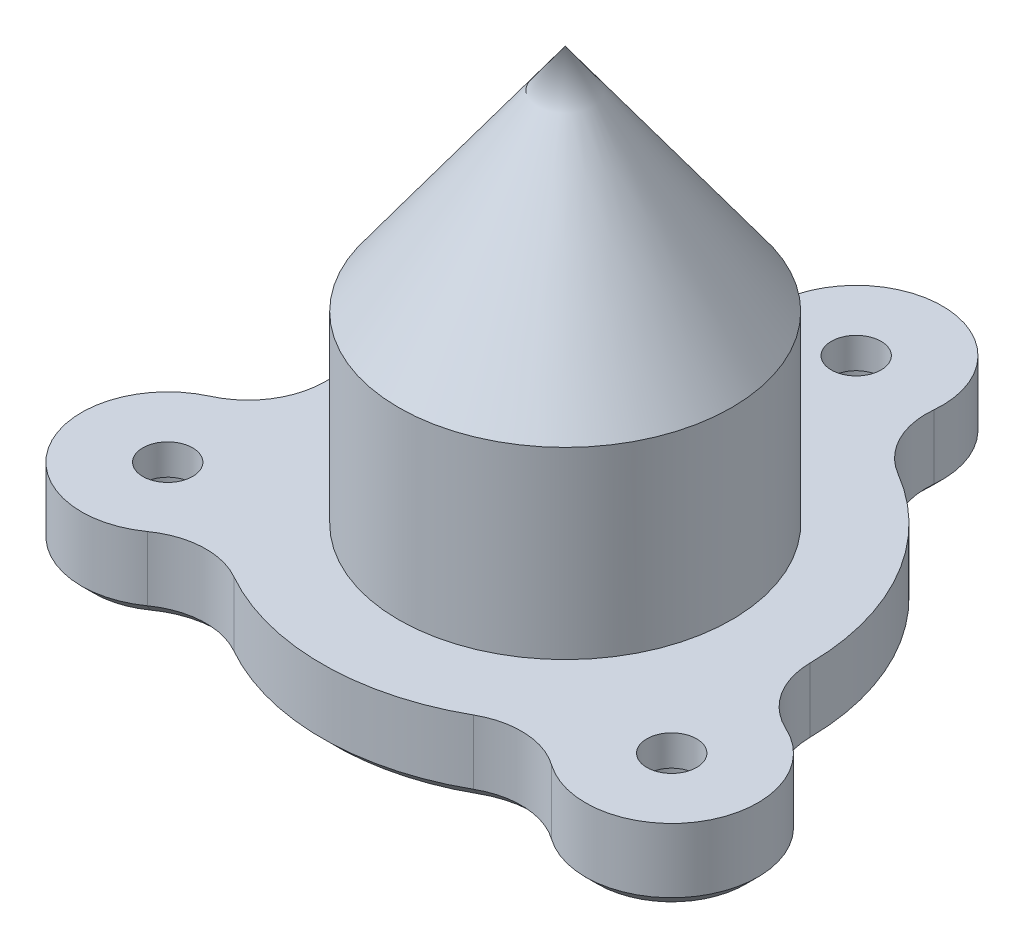
ISO-10303-21;
HEADER;
FILE_DESCRIPTION(('STEP AP214'),'2;1');
FILE_NAME('part.step','',(''),(''),'','','');
FILE_SCHEMA(('AUTOMOTIVE_DESIGN { 1 0 10303 214 1 1 1 1 }'));
ENDSEC;
DATA;
#1=APPLICATION_CONTEXT('core data for automotive mechanical design processes');
#2=APPLICATION_PROTOCOL_DEFINITION('international standard','automotive_design',2000,#1);
#3=PRODUCT_CONTEXT('',#1,'mechanical');
#4=PRODUCT('Part','Part','',(#3));
#5=PRODUCT_RELATED_PRODUCT_CATEGORY('part','',(#4));
#6=PRODUCT_DEFINITION_FORMATION('','',#4);
#7=PRODUCT_DEFINITION_CONTEXT('part definition',#1,'design');
#8=PRODUCT_DEFINITION('design','',#6,#7);
#9=PRODUCT_DEFINITION_SHAPE('','',#8);
#10=(LENGTH_UNIT() NAMED_UNIT(*) SI_UNIT(.MILLI.,.METRE.));
#11=(NAMED_UNIT(*) PLANE_ANGLE_UNIT() SI_UNIT($,.RADIAN.));
#12=(NAMED_UNIT(*) SI_UNIT($,.STERADIAN.) SOLID_ANGLE_UNIT());
#13=UNCERTAINTY_MEASURE_WITH_UNIT(LENGTH_MEASURE(1.E-05),#10,'distance_accuracy_value','');
#14=(GEOMETRIC_REPRESENTATION_CONTEXT(3) GLOBAL_UNCERTAINTY_ASSIGNED_CONTEXT((#13)) GLOBAL_UNIT_ASSIGNED_CONTEXT((#10,
#11,#12)) REPRESENTATION_CONTEXT('',''));
#15=CARTESIAN_POINT('',(0.,0.,0.));
#16=DIRECTION('',(0.,0.,1.));
#17=DIRECTION('',(1.,0.,0.));
#18=AXIS2_PLACEMENT_3D('',#15,#16,#17);
#19=CARTESIAN_POINT('',(0.,5.,-19.));
#20=DIRECTION('',(0.,-1.,0.));
#21=DIRECTION('',(0.,0.,-1.));
#22=AXIS2_PLACEMENT_3D('',#19,#20,#21);
#23=CYLINDRICAL_SURFACE('',#22,1.625);
#24=CARTESIAN_POINT('',(0.,5.,-19.));
#25=DIRECTION('',(0.,1.,0.));
#26=DIRECTION('',(0.,0.,1.));
#27=AXIS2_PLACEMENT_3D('',#24,#25,#26);
#28=CIRCLE('',#27,1.625);
#29=CARTESIAN_POINT('',(0.,5.,-17.375));
#30=VERTEX_POINT('',#29);
#31=EDGE_CURVE('E189',#30,#30,#28,.T.);
#32=ORIENTED_EDGE('',*,*,#31,.T.);
#33=EDGE_LOOP('',(#32));
#34=FACE_BOUND('',#33,.T.);
#35=CARTESIAN_POINT('',(0.,3.,-19.));
#36=DIRECTION('',(0.,-1.,0.));
#37=DIRECTION('',(0.,0.,-1.));
#38=AXIS2_PLACEMENT_3D('',#35,#36,#37);
#39=CIRCLE('',#38,1.625);
#40=CARTESIAN_POINT('',(0.,3.,-20.625));
#41=VERTEX_POINT('',#40);
#42=EDGE_CURVE('E305',#41,#41,#39,.T.);
#43=ORIENTED_EDGE('',*,*,#42,.T.);
#44=EDGE_LOOP('',(#43));
#45=FACE_BOUND('',#44,.T.);
#46=ADVANCED_FACE('F35',(#34,#45),#23,.F.);
#47=CARTESIAN_POINT('',(16.4544826719043,5.,9.5));
#48=DIRECTION('',(0.,-1.,0.));
#49=DIRECTION('',(0.,0.,-1.));
#50=AXIS2_PLACEMENT_3D('',#47,#48,#49);
#51=CYLINDRICAL_SURFACE('',#50,1.625);
#52=CARTESIAN_POINT('',(16.4544826719043,5.,9.5));
#53=DIRECTION('',(0.,1.,0.));
#54=DIRECTION('',(0.,0.,1.));
#55=AXIS2_PLACEMENT_3D('',#52,#53,#54);
#56=CIRCLE('',#55,1.625);
#57=CARTESIAN_POINT('',(16.4544826719043,5.,11.125));
#58=VERTEX_POINT('',#57);
#59=EDGE_CURVE('E178',#58,#58,#56,.T.);
#60=ORIENTED_EDGE('',*,*,#59,.T.);
#61=EDGE_LOOP('',(#60));
#62=FACE_BOUND('',#61,.T.);
#63=CARTESIAN_POINT('',(16.4544826719043,3.,9.5));
#64=DIRECTION('',(0.,-1.,0.));
#65=DIRECTION('',(0.,0.,-1.));
#66=AXIS2_PLACEMENT_3D('',#63,#64,#65);
#67=CIRCLE('',#66,1.625);
#68=CARTESIAN_POINT('',(16.4544826719043,3.,7.875));
#69=VERTEX_POINT('',#68);
#70=EDGE_CURVE('E336',#69,#69,#67,.T.);
#71=ORIENTED_EDGE('',*,*,#70,.T.);
#72=EDGE_LOOP('',(#71));
#73=FACE_BOUND('',#72,.T.);
#74=ADVANCED_FACE('F372',(#62,#73),#51,.F.);
#75=CARTESIAN_POINT('',(-16.4544826719043,5.,9.50000000000001));
#76=DIRECTION('',(0.,-1.,0.));
#77=DIRECTION('',(0.,0.,-1.));
#78=AXIS2_PLACEMENT_3D('',#75,#76,#77);
#79=CYLINDRICAL_SURFACE('',#78,1.625);
#80=CARTESIAN_POINT('',(-16.4544826719043,5.,9.50000000000001));
#81=DIRECTION('',(0.,1.,0.));
#82=DIRECTION('',(0.,0.,1.));
#83=AXIS2_PLACEMENT_3D('',#80,#81,#82);
#84=CIRCLE('',#83,1.625);
#85=CARTESIAN_POINT('',(-16.4544826719043,5.,11.125));
#86=VERTEX_POINT('',#85);
#87=EDGE_CURVE('E174',#86,#86,#84,.T.);
#88=ORIENTED_EDGE('',*,*,#87,.T.);
#89=EDGE_LOOP('',(#88));
#90=FACE_BOUND('',#89,.T.);
#91=CARTESIAN_POINT('',(-16.4544826719043,3.,9.50000000000001));
#92=DIRECTION('',(0.,-1.,0.));
#93=DIRECTION('',(0.,0.,-1.));
#94=AXIS2_PLACEMENT_3D('',#91,#92,#93);
#95=CIRCLE('',#94,1.625);
#96=CARTESIAN_POINT('',(-16.4544826719043,3.,7.87500000000001));
#97=VERTEX_POINT('',#96);
#98=EDGE_CURVE('E333',#97,#97,#95,.T.);
#99=ORIENTED_EDGE('',*,*,#98,.T.);
#100=EDGE_LOOP('',(#99));
#101=FACE_BOUND('',#100,.T.);
#102=ADVANCED_FACE('F378',(#90,#101),#79,.F.);
#103=CARTESIAN_POINT('',(5.28876250251404,5.,-8.9983552631579));
#104=DIRECTION('',(0.,1.,0.));
#105=DIRECTION('',(0.,0.,1.));
#106=AXIS2_PLACEMENT_3D('',#103,#104,#105);
#107=PLANE('',#106);
#108=ORIENTED_EDGE('',*,*,#59,.F.);
#109=EDGE_LOOP('',(#108));
#110=FACE_BOUND('',#109,.T.);
#111=CARTESIAN_POINT('',(0.,5.,0.));
#112=DIRECTION('',(0.,1.,0.));
#113=DIRECTION('',(0.,0.,1.));
#114=AXIS2_PLACEMENT_3D('',#111,#112,#113);
#115=CIRCLE('',#114,10.875);
#116=CARTESIAN_POINT('',(0.,5.,10.875));
#117=VERTEX_POINT('',#116);
#118=EDGE_CURVE('E192',#117,#117,#115,.T.);
#119=ORIENTED_EDGE('',*,*,#118,.F.);
#120=EDGE_LOOP('',(#119));
#121=FACE_BOUND('',#120,.T.);
#122=CARTESIAN_POINT('',(0.,5.,0.));
#123=DIRECTION('',(0.,1.,0.));
#124=DIRECTION('',(0.,0.,1.));
#125=AXIS2_PLACEMENT_3D('',#122,#123,#124);
#126=CIRCLE('',#125,15.875);
#127=CARTESIAN_POINT('',(15.8745216608563,5.,-0.123235705065375));
#128=VERTEX_POINT('',#127);
#129=CARTESIAN_POINT('',(8.04398608166807,5.,-13.6861211786952));
#130=VERTEX_POINT('',#129);
#131=EDGE_CURVE('E195',#128,#130,#126,.T.);
#132=ORIENTED_EDGE('',*,*,#131,.T.);
#133=CARTESIAN_POINT('',(10.5775250050281,5.,-17.9967105263158));
#134=DIRECTION('',(0.,-1.,0.));
#135=DIRECTION('',(0.,0.,1.));
#136=AXIS2_PLACEMENT_3D('',#133,#134,#135);
#137=CIRCLE('',#136,5.);
#138=CARTESIAN_POINT('',(5.59986617913252,5.,-18.468846749226));
#139=VERTEX_POINT('',#138);
#140=EDGE_CURVE('E198',#130,#139,#137,.T.);
#141=ORIENTED_EDGE('',*,*,#140,.T.);
#142=CARTESIAN_POINT('',(0.,5.,-19.));
#143=DIRECTION('',(0.,1.,0.));
#144=DIRECTION('',(0.,0.,1.));
#145=AXIS2_PLACEMENT_3D('',#142,#143,#144);
#146=CIRCLE('',#145,5.625);
#147=CARTESIAN_POINT('',(-5.59986617913252,5.,-18.468846749226));
#148=VERTEX_POINT('',#147);
#149=EDGE_CURVE('E200',#139,#148,#146,.T.);
#150=ORIENTED_EDGE('',*,*,#149,.T.);
#151=CARTESIAN_POINT('',(-10.5775250050281,5.,-17.9967105263158));
#152=DIRECTION('',(0.,-1.,0.));
#153=DIRECTION('',(0.,0.,-1.));
#154=AXIS2_PLACEMENT_3D('',#151,#152,#153);
#155=CIRCLE('',#154,5.);
#156=CARTESIAN_POINT('',(-8.04398608166807,5.,-13.6861211786952));
#157=VERTEX_POINT('',#156);
#158=EDGE_CURVE('E202',#148,#157,#155,.T.);
#159=ORIENTED_EDGE('',*,*,#158,.T.);
#160=CARTESIAN_POINT('',(0.,5.,0.));
#161=DIRECTION('',(0.,1.,0.));
#162=DIRECTION('',(0.,0.,1.));
#163=AXIS2_PLACEMENT_3D('',#160,#161,#162);
#164=CIRCLE('',#163,15.875);
#165=CARTESIAN_POINT('',(-15.8745216608563,5.,-0.123235705065376));
#166=VERTEX_POINT('',#165);
#167=EDGE_CURVE('E204',#157,#166,#164,.T.);
#168=ORIENTED_EDGE('',*,*,#167,.T.);
#169=CARTESIAN_POINT('',(-20.8743710028583,5.,-0.162050100361541));
#170=DIRECTION('',(0.,-1.,0.));
#171=DIRECTION('',(0.,0.,1.));
#172=AXIS2_PLACEMENT_3D('',#169,#170,#171);
#173=CIRCLE('',#172,5.);
#174=CARTESIAN_POINT('',(-18.7944235529976,5.,4.38479700569096));
#175=VERTEX_POINT('',#174);
#176=EDGE_CURVE('E206',#166,#175,#173,.T.);
#177=ORIENTED_EDGE('',*,*,#176,.T.);
#178=CARTESIAN_POINT('',(-16.4544826719043,5.,9.50000000000001));
#179=DIRECTION('',(0.,1.,0.));
#180=DIRECTION('',(0.,0.,1.));
#181=AXIS2_PLACEMENT_3D('',#178,#179,#180);
#182=CIRCLE('',#181,5.625);
#183=CARTESIAN_POINT('',(-13.1945573738651,5.,14.0840497435351));
#184=VERTEX_POINT('',#183);
#185=EDGE_CURVE('E208',#175,#184,#182,.T.);
#186=ORIENTED_EDGE('',*,*,#185,.T.);
#187=CARTESIAN_POINT('',(-10.2968459978302,5.,18.1587606266774));
#188=DIRECTION('',(0.,-1.,0.));
#189=DIRECTION('',(0.,0.,-1.));
#190=AXIS2_PLACEMENT_3D('',#187,#188,#189);
#191=CIRCLE('',#190,5.);
#192=CARTESIAN_POINT('',(-7.83053557918826,5.,13.8093568837606));
#193=VERTEX_POINT('',#192);
#194=EDGE_CURVE('E210',#184,#193,#191,.T.);
#195=ORIENTED_EDGE('',*,*,#194,.T.);
#196=CARTESIAN_POINT('',(0.,5.,0.));
#197=DIRECTION('',(0.,1.,0.));
#198=DIRECTION('',(0.,0.,1.));
#199=AXIS2_PLACEMENT_3D('',#196,#197,#198);
#200=CIRCLE('',#199,15.875);
#201=CARTESIAN_POINT('',(7.83053557918827,5.,13.8093568837606));
#202=VERTEX_POINT('',#201);
#203=EDGE_CURVE('E212',#193,#202,#200,.T.);
#204=ORIENTED_EDGE('',*,*,#203,.T.);
#205=CARTESIAN_POINT('',(10.2968459978303,5.,18.1587606266773));
#206=DIRECTION('',(0.,-1.,0.));
#207=DIRECTION('',(0.,0.,1.));
#208=AXIS2_PLACEMENT_3D('',#205,#206,#207);
#209=CIRCLE('',#208,5.);
#210=CARTESIAN_POINT('',(13.1945573738651,5.,14.0840497435351));
#211=VERTEX_POINT('',#210);
#212=EDGE_CURVE('E214',#202,#211,#209,.T.);
#213=ORIENTED_EDGE('',*,*,#212,.T.);
#214=CARTESIAN_POINT('',(16.4544826719043,5.,9.5));
#215=DIRECTION('',(0.,1.,0.));
#216=DIRECTION('',(0.,0.,1.));
#217=AXIS2_PLACEMENT_3D('',#214,#215,#216);
#218=CIRCLE('',#217,5.625);
#219=CARTESIAN_POINT('',(18.7944235529976,5.,4.38479700569094));
#220=VERTEX_POINT('',#219);
#221=EDGE_CURVE('E216',#211,#220,#218,.T.);
#222=ORIENTED_EDGE('',*,*,#221,.T.);
#223=CARTESIAN_POINT('',(20.8743710028583,5.,-0.162050100361556));
#224=DIRECTION('',(0.,-1.,0.));
#225=DIRECTION('',(0.,0.,-1.));
#226=AXIS2_PLACEMENT_3D('',#223,#224,#225);
#227=CIRCLE('',#226,5.);
#228=EDGE_CURVE('E218',#220,#128,#227,.T.);
#229=ORIENTED_EDGE('',*,*,#228,.T.);
#230=EDGE_LOOP('',(#132,#141,#150,#159,#168,#177,#186,#195,#204,#213,#222,#229));
#231=FACE_BOUND('',#230,.T.);
#232=ORIENTED_EDGE('',*,*,#31,.F.);
#233=EDGE_LOOP('',(#232));
#234=FACE_BOUND('',#233,.T.);
#235=ORIENTED_EDGE('',*,*,#87,.F.);
#236=EDGE_LOOP('',(#235));
#237=FACE_BOUND('',#236,.T.);
#238=ADVANCED_FACE('F384',(#110,#121,#231,#234,#237),#107,.T.);
#239=CARTESIAN_POINT('',(5.28876250251404,0.,-8.9983552631579));
#240=DIRECTION('',(0.,1.,0.));
#241=DIRECTION('',(0.,0.,1.));
#242=AXIS2_PLACEMENT_3D('',#239,#240,#241);
#243=PLANE('',#242);
#244=CARTESIAN_POINT('',(0.,0.,-19.));
#245=DIRECTION('',(0.,1.,0.));
#246=DIRECTION('',(0.,0.,1.));
#247=AXIS2_PLACEMENT_3D('',#244,#245,#246);
#248=CIRCLE('',#247,3.275);
#249=CARTESIAN_POINT('',(0.,0.,-15.725));
#250=VERTEX_POINT('',#249);
#251=EDGE_CURVE('E350',#250,#250,#248,.T.);
#252=ORIENTED_EDGE('',*,*,#251,.T.);
#253=EDGE_LOOP('',(#252));
#254=FACE_BOUND('',#253,.T.);
#255=CARTESIAN_POINT('',(-16.4544826719043,0.,9.50000000000008));
#256=DIRECTION('',(0.,1.,0.));
#257=DIRECTION('',(0.,0.,1.));
#258=AXIS2_PLACEMENT_3D('',#255,#256,#257);
#259=CIRCLE('',#258,3.275);
#260=CARTESIAN_POINT('',(-16.4544826719043,0.,12.7750000000001));
#261=VERTEX_POINT('',#260);
#262=EDGE_CURVE('E347',#261,#261,#259,.T.);
#263=ORIENTED_EDGE('',*,*,#262,.T.);
#264=EDGE_LOOP('',(#263));
#265=FACE_BOUND('',#264,.T.);
#266=CARTESIAN_POINT('',(16.4544826719044,0.,9.49999999999985));
#267=DIRECTION('',(0.,1.,0.));
#268=DIRECTION('',(0.,0.,1.));
#269=AXIS2_PLACEMENT_3D('',#266,#267,#268);
#270=CIRCLE('',#269,3.275);
#271=CARTESIAN_POINT('',(16.4544826719044,0.,12.7749999999998));
#272=VERTEX_POINT('',#271);
#273=EDGE_CURVE('E344',#272,#272,#270,.T.);
#274=ORIENTED_EDGE('',*,*,#273,.T.);
#275=EDGE_LOOP('',(#274));
#276=FACE_BOUND('',#275,.T.);
#277=CARTESIAN_POINT('',(-10.5775250050281,0.,-17.9967105263158));
#278=DIRECTION('',(0.,1.,0.));
#279=DIRECTION('',(0.,0.,1.));
#280=AXIS2_PLACEMENT_3D('',#277,#278,#279);
#281=CIRCLE('',#280,5.8);
#282=CARTESIAN_POINT('',(-7.63861985393046,0.,-12.996426883076));
#283=VERTEX_POINT('',#282);
#284=CARTESIAN_POINT('',(-4.80344076698922,0.,-18.5443885448916));
#285=VERTEX_POINT('',#284);
#286=EDGE_CURVE('E276',#283,#285,#281,.T.);
#287=ORIENTED_EDGE('',*,*,#286,.T.);
#288=CARTESIAN_POINT('',(0.,0.,-19.));
#289=DIRECTION('',(0.,1.,0.));
#290=DIRECTION('',(0.,0.,1.));
#291=AXIS2_PLACEMENT_3D('',#288,#289,#290);
#292=CIRCLE('',#291,4.825);
#293=CARTESIAN_POINT('',(4.80344076698922,0.,-18.5443885448916));
#294=VERTEX_POINT('',#293);
#295=EDGE_CURVE('E278',#285,#294,#292,.F.);
#296=ORIENTED_EDGE('',*,*,#295,.T.);
#297=CARTESIAN_POINT('',(10.5775250050281,0.,-17.9967105263158));
#298=DIRECTION('',(0.,1.,0.));
#299=DIRECTION('',(0.,0.,1.));
#300=AXIS2_PLACEMENT_3D('',#297,#298,#299);
#301=CIRCLE('',#300,5.8);
#302=CARTESIAN_POINT('',(7.63861985393046,0.,-12.996426883076));
#303=VERTEX_POINT('',#302);
#304=EDGE_CURVE('E274',#294,#303,#301,.T.);
#305=ORIENTED_EDGE('',*,*,#304,.T.);
#306=CARTESIAN_POINT('',(0.,0.,0.));
#307=DIRECTION('',(0.,1.,0.));
#308=DIRECTION('',(0.,0.,1.));
#309=AXIS2_PLACEMENT_3D('',#306,#307,#308);
#310=CIRCLE('',#309,15.075);
#311=CARTESIAN_POINT('',(15.074545766136,0.,-0.117025401817986));
#312=VERTEX_POINT('',#311);
#313=EDGE_CURVE('E270',#303,#312,#310,.F.);
#314=ORIENTED_EDGE('',*,*,#313,.T.);
#315=CARTESIAN_POINT('',(20.8743710028583,0.,-0.162050100361556));
#316=DIRECTION('',(0.,1.,0.));
#317=DIRECTION('',(0.,0.,1.));
#318=AXIS2_PLACEMENT_3D('',#315,#316,#317);
#319=CIRCLE('',#318,5.80000000000001);
#320=CARTESIAN_POINT('',(18.4616319610199,0.,5.11229254265934));
#321=VERTEX_POINT('',#320);
#322=EDGE_CURVE('E266',#312,#321,#319,.T.);
#323=ORIENTED_EDGE('',*,*,#322,.T.);
#324=CARTESIAN_POINT('',(16.4544826719043,0.,9.5));
#325=DIRECTION('',(0.,1.,0.));
#326=DIRECTION('',(0.,0.,1.));
#327=AXIS2_PLACEMENT_3D('',#324,#325,#326);
#328=CIRCLE('',#327,4.825);
#329=CARTESIAN_POINT('',(13.6581911940307,0.,13.4320960022323));
#330=VERTEX_POINT('',#329);
#331=EDGE_CURVE('E262',#321,#330,#328,.F.);
#332=ORIENTED_EDGE('',*,*,#331,.T.);
#333=CARTESIAN_POINT('',(10.2968459978303,0.,18.1587606266773));
#334=DIRECTION('',(0.,1.,0.));
#335=DIRECTION('',(0.,0.,1.));
#336=AXIS2_PLACEMENT_3D('',#333,#334,#335);
#337=CIRCLE('',#336,5.8);
#338=CARTESIAN_POINT('',(7.43592591220556,0.,13.1134522848939));
#339=VERTEX_POINT('',#338);
#340=EDGE_CURVE('E258',#330,#339,#337,.T.);
#341=ORIENTED_EDGE('',*,*,#340,.T.);
#342=CARTESIAN_POINT('',(0.,0.,0.));
#343=DIRECTION('',(0.,1.,0.));
#344=DIRECTION('',(0.,0.,1.));
#345=AXIS2_PLACEMENT_3D('',#342,#343,#344);
#346=CIRCLE('',#345,15.075);
#347=CARTESIAN_POINT('',(-7.43592591220555,0.,13.1134522848939));
#348=VERTEX_POINT('',#347);
#349=EDGE_CURVE('E256',#339,#348,#346,.F.);
#350=ORIENTED_EDGE('',*,*,#349,.T.);
#351=CARTESIAN_POINT('',(-10.2968459978302,0.,18.1587606266774));
#352=DIRECTION('',(0.,1.,0.));
#353=DIRECTION('',(0.,0.,1.));
#354=AXIS2_PLACEMENT_3D('',#351,#352,#353);
#355=CIRCLE('',#354,5.80000000000001);
#356=CARTESIAN_POINT('',(-13.6581911940307,0.,13.4320960022323));
#357=VERTEX_POINT('',#356);
#358=EDGE_CURVE('E260',#348,#357,#355,.T.);
#359=ORIENTED_EDGE('',*,*,#358,.T.);
#360=CARTESIAN_POINT('',(-16.4544826719043,0.,9.50000000000001));
#361=DIRECTION('',(0.,1.,0.));
#362=DIRECTION('',(0.,0.,1.));
#363=AXIS2_PLACEMENT_3D('',#360,#361,#362);
#364=CIRCLE('',#363,4.825);
#365=CARTESIAN_POINT('',(-18.4616319610199,0.,5.11229254265936));
#366=VERTEX_POINT('',#365);
#367=EDGE_CURVE('E264',#357,#366,#364,.F.);
#368=ORIENTED_EDGE('',*,*,#367,.T.);
#369=CARTESIAN_POINT('',(-20.8743710028583,0.,-0.162050100361541));
#370=DIRECTION('',(0.,1.,0.));
#371=DIRECTION('',(0.,0.,1.));
#372=AXIS2_PLACEMENT_3D('',#369,#370,#371);
#373=CIRCLE('',#372,5.8);
#374=CARTESIAN_POINT('',(-15.074545766136,0.,-0.117025401817987));
#375=VERTEX_POINT('',#374);
#376=EDGE_CURVE('E268',#366,#375,#373,.T.);
#377=ORIENTED_EDGE('',*,*,#376,.T.);
#378=CARTESIAN_POINT('',(0.,0.,0.));
#379=DIRECTION('',(0.,1.,0.));
#380=DIRECTION('',(0.,0.,1.));
#381=AXIS2_PLACEMENT_3D('',#378,#379,#380);
#382=CIRCLE('',#381,15.075);
#383=EDGE_CURVE('E272',#375,#283,#382,.F.);
#384=ORIENTED_EDGE('',*,*,#383,.T.);
#385=EDGE_LOOP('',(#287,#296,#305,#314,#323,#332,#341,#350,#359,#368,#377,#384));
#386=FACE_BOUND('',#385,.T.);
#387=ADVANCED_FACE('F387',(#254,#265,#276,#386),#243,.F.);
#388=CARTESIAN_POINT('',(0.,5.,0.));
#389=DIRECTION('',(0.,-1.,0.));
#390=DIRECTION('',(0.,0.,-1.));
#391=AXIS2_PLACEMENT_3D('',#388,#389,#390);
#392=CYLINDRICAL_SURFACE('',#391,15.875);
#393=DIRECTION('',(0.,-1.,0.));
#394=VECTOR('',#393,1.);
#395=CARTESIAN_POINT('',(15.8745216608563,5.,-0.123235705065375));
#396=LINE('',#395,#394);
#397=CARTESIAN_POINT('',(15.8745216608563,0.800000000000002,-0.123235705065375));
#398=VERTEX_POINT('',#397);
#399=EDGE_CURVE('E220',#128,#398,#396,.T.);
#400=ORIENTED_EDGE('',*,*,#399,.T.);
#401=CARTESIAN_POINT('',(0.,0.800000000000002,0.));
#402=DIRECTION('',(0.,1.,0.));
#403=DIRECTION('',(0.,0.,1.));
#404=AXIS2_PLACEMENT_3D('',#401,#402,#403);
#405=CIRCLE('',#404,15.875);
#406=CARTESIAN_POINT('',(8.04398608166807,0.800000000000002,-13.6861211786952));
#407=VERTEX_POINT('',#406);
#408=EDGE_CURVE('E287',#398,#407,#405,.T.);
#409=ORIENTED_EDGE('',*,*,#408,.T.);
#410=DIRECTION('',(0.,-1.,0.));
#411=VECTOR('',#410,1.);
#412=CARTESIAN_POINT('',(8.04398608166807,5.,-13.6861211786952));
#413=LINE('',#412,#411);
#414=EDGE_CURVE('E250',#130,#407,#413,.T.);
#415=ORIENTED_EDGE('',*,*,#414,.F.);
#416=ORIENTED_EDGE('',*,*,#131,.F.);
#417=EDGE_LOOP('',(#400,#409,#415,#416));
#418=FACE_BOUND('',#417,.T.);
#419=ADVANCED_FACE('F391',(#418),#392,.T.);
#420=CARTESIAN_POINT('',(10.5775250050281,5.,-17.9967105263158));
#421=DIRECTION('',(0.,-1.,0.));
#422=DIRECTION('',(0.,0.,-1.));
#423=AXIS2_PLACEMENT_3D('',#420,#421,#422);
#424=CYLINDRICAL_SURFACE('',#423,5.);
#425=ORIENTED_EDGE('',*,*,#414,.T.);
#426=CARTESIAN_POINT('',(10.5775250050281,0.800000000000002,-17.9967105263158));
#427=DIRECTION('',(0.,1.,0.));
#428=DIRECTION('',(0.,0.,1.));
#429=AXIS2_PLACEMENT_3D('',#426,#427,#428);
#430=CIRCLE('',#429,5.);
#431=CARTESIAN_POINT('',(5.59986617913252,0.800000000000002,-18.468846749226));
#432=VERTEX_POINT('',#431);
#433=EDGE_CURVE('E283',#407,#432,#430,.F.);
#434=ORIENTED_EDGE('',*,*,#433,.T.);
#435=DIRECTION('',(0.,-1.,0.));
#436=VECTOR('',#435,1.);
#437=CARTESIAN_POINT('',(5.59986617913252,5.,-18.468846749226));
#438=LINE('',#437,#436);
#439=EDGE_CURVE('E247',#139,#432,#438,.T.);
#440=ORIENTED_EDGE('',*,*,#439,.F.);
#441=ORIENTED_EDGE('',*,*,#140,.F.);
#442=EDGE_LOOP('',(#425,#434,#440,#441));
#443=FACE_BOUND('',#442,.T.);
#444=ADVANCED_FACE('F430',(#443),#424,.F.);
#445=CARTESIAN_POINT('',(0.,5.,-19.));
#446=DIRECTION('',(0.,-1.,0.));
#447=DIRECTION('',(0.,0.,-1.));
#448=AXIS2_PLACEMENT_3D('',#445,#446,#447);
#449=CYLINDRICAL_SURFACE('',#448,5.625);
#450=ORIENTED_EDGE('',*,*,#439,.T.);
#451=CARTESIAN_POINT('',(0.,0.800000000000002,-19.));
#452=DIRECTION('',(0.,1.,0.));
#453=DIRECTION('',(0.,0.,1.));
#454=AXIS2_PLACEMENT_3D('',#451,#452,#453);
#455=CIRCLE('',#454,5.625);
#456=CARTESIAN_POINT('',(-5.59986617913252,0.800000000000002,-18.468846749226));
#457=VERTEX_POINT('',#456);
#458=EDGE_CURVE('E253',#432,#457,#455,.T.);
#459=ORIENTED_EDGE('',*,*,#458,.T.);
#460=DIRECTION('',(0.,-1.,0.));
#461=VECTOR('',#460,1.);
#462=CARTESIAN_POINT('',(-5.59986617913252,5.,-18.468846749226));
#463=LINE('',#462,#461);
#464=EDGE_CURVE('E244',#148,#457,#463,.T.);
#465=ORIENTED_EDGE('',*,*,#464,.F.);
#466=ORIENTED_EDGE('',*,*,#149,.F.);
#467=EDGE_LOOP('',(#450,#459,#465,#466));
#468=FACE_BOUND('',#467,.T.);
#469=ADVANCED_FACE('F426',(#468),#449,.T.);
#470=CARTESIAN_POINT('',(-10.5775250050281,5.,-17.9967105263158));
#471=DIRECTION('',(0.,-1.,0.));
#472=DIRECTION('',(0.,0.,-1.));
#473=AXIS2_PLACEMENT_3D('',#470,#471,#472);
#474=CYLINDRICAL_SURFACE('',#473,5.);
#475=ORIENTED_EDGE('',*,*,#464,.T.);
#476=CARTESIAN_POINT('',(-10.5775250050281,0.800000000000002,-17.9967105263158));
#477=DIRECTION('',(0.,1.,0.));
#478=DIRECTION('',(0.,0.,1.));
#479=AXIS2_PLACEMENT_3D('',#476,#477,#478);
#480=CIRCLE('',#479,5.);
#481=CARTESIAN_POINT('',(-8.04398608166807,0.800000000000002,-13.6861211786952));
#482=VERTEX_POINT('',#481);
#483=EDGE_CURVE('E281',#457,#482,#480,.F.);
#484=ORIENTED_EDGE('',*,*,#483,.T.);
#485=DIRECTION('',(0.,-1.,0.));
#486=VECTOR('',#485,1.);
#487=CARTESIAN_POINT('',(-8.04398608166807,5.,-13.6861211786952));
#488=LINE('',#487,#486);
#489=EDGE_CURVE('E241',#157,#482,#488,.T.);
#490=ORIENTED_EDGE('',*,*,#489,.F.);
#491=ORIENTED_EDGE('',*,*,#158,.F.);
#492=EDGE_LOOP('',(#475,#484,#490,#491));
#493=FACE_BOUND('',#492,.T.);
#494=ADVANCED_FACE('F422',(#493),#474,.F.);
#495=CARTESIAN_POINT('',(0.,5.,0.));
#496=DIRECTION('',(0.,-1.,0.));
#497=DIRECTION('',(0.,0.,-1.));
#498=AXIS2_PLACEMENT_3D('',#495,#496,#497);
#499=CYLINDRICAL_SURFACE('',#498,15.875);
#500=ORIENTED_EDGE('',*,*,#489,.T.);
#501=CARTESIAN_POINT('',(0.,0.800000000000002,0.));
#502=DIRECTION('',(0.,1.,0.));
#503=DIRECTION('',(0.,0.,1.));
#504=AXIS2_PLACEMENT_3D('',#501,#502,#503);
#505=CIRCLE('',#504,15.875);
#506=CARTESIAN_POINT('',(-15.8745216608563,0.800000000000002,-0.123235705065376));
#507=VERTEX_POINT('',#506);
#508=EDGE_CURVE('E285',#482,#507,#505,.T.);
#509=ORIENTED_EDGE('',*,*,#508,.T.);
#510=DIRECTION('',(0.,-1.,0.));
#511=VECTOR('',#510,1.);
#512=CARTESIAN_POINT('',(-15.8745216608563,5.,-0.123235705065376));
#513=LINE('',#512,#511);
#514=EDGE_CURVE('E238',#166,#507,#513,.T.);
#515=ORIENTED_EDGE('',*,*,#514,.F.);
#516=ORIENTED_EDGE('',*,*,#167,.F.);
#517=EDGE_LOOP('',(#500,#509,#515,#516));
#518=FACE_BOUND('',#517,.T.);
#519=ADVANCED_FACE('F418',(#518),#499,.T.);
#520=CARTESIAN_POINT('',(-20.8743710028583,5.,-0.162050100361541));
#521=DIRECTION('',(0.,-1.,0.));
#522=DIRECTION('',(0.,0.,-1.));
#523=AXIS2_PLACEMENT_3D('',#520,#521,#522);
#524=CYLINDRICAL_SURFACE('',#523,5.);
#525=ORIENTED_EDGE('',*,*,#514,.T.);
#526=CARTESIAN_POINT('',(-20.8743710028583,0.800000000000002,-0.162050100361541));
#527=DIRECTION('',(0.,1.,0.));
#528=DIRECTION('',(0.,0.,1.));
#529=AXIS2_PLACEMENT_3D('',#526,#527,#528);
#530=CIRCLE('',#529,5.);
#531=CARTESIAN_POINT('',(-18.7944235529976,0.800000000000002,4.38479700569096));
#532=VERTEX_POINT('',#531);
#533=EDGE_CURVE('E289',#507,#532,#530,.F.);
#534=ORIENTED_EDGE('',*,*,#533,.T.);
#535=DIRECTION('',(0.,-1.,0.));
#536=VECTOR('',#535,1.);
#537=CARTESIAN_POINT('',(-18.7944235529976,5.,4.38479700569096));
#538=LINE('',#537,#536);
#539=EDGE_CURVE('E235',#175,#532,#538,.T.);
#540=ORIENTED_EDGE('',*,*,#539,.F.);
#541=ORIENTED_EDGE('',*,*,#176,.F.);
#542=EDGE_LOOP('',(#525,#534,#540,#541));
#543=FACE_BOUND('',#542,.T.);
#544=ADVANCED_FACE('F414',(#543),#524,.F.);
#545=CARTESIAN_POINT('',(-16.4544826719043,5.,9.50000000000001));
#546=DIRECTION('',(0.,-1.,0.));
#547=DIRECTION('',(0.,0.,-1.));
#548=AXIS2_PLACEMENT_3D('',#545,#546,#547);
#549=CYLINDRICAL_SURFACE('',#548,5.625);
#550=ORIENTED_EDGE('',*,*,#539,.T.);
#551=CARTESIAN_POINT('',(-16.4544826719043,0.800000000000002,9.50000000000001));
#552=DIRECTION('',(0.,1.,0.));
#553=DIRECTION('',(0.,0.,1.));
#554=AXIS2_PLACEMENT_3D('',#551,#552,#553);
#555=CIRCLE('',#554,5.625);
#556=CARTESIAN_POINT('',(-13.1945573738651,0.800000000000002,14.0840497435351));
#557=VERTEX_POINT('',#556);
#558=EDGE_CURVE('E293',#532,#557,#555,.T.);
#559=ORIENTED_EDGE('',*,*,#558,.T.);
#560=DIRECTION('',(0.,-1.,0.));
#561=VECTOR('',#560,1.);
#562=CARTESIAN_POINT('',(-13.1945573738651,5.,14.0840497435351));
#563=LINE('',#562,#561);
#564=EDGE_CURVE('E233',#184,#557,#563,.T.);
#565=ORIENTED_EDGE('',*,*,#564,.F.);
#566=ORIENTED_EDGE('',*,*,#185,.F.);
#567=EDGE_LOOP('',(#550,#559,#565,#566));
#568=FACE_BOUND('',#567,.T.);
#569=ADVANCED_FACE('F411',(#568),#549,.T.);
#570=CARTESIAN_POINT('',(-10.2968459978302,5.,18.1587606266774));
#571=DIRECTION('',(0.,-1.,0.));
#572=DIRECTION('',(0.,0.,-1.));
#573=AXIS2_PLACEMENT_3D('',#570,#571,#572);
#574=CYLINDRICAL_SURFACE('',#573,5.);
#575=ORIENTED_EDGE('',*,*,#564,.T.);
#576=CARTESIAN_POINT('',(-10.2968459978302,0.800000000000002,18.1587606266774));
#577=DIRECTION('',(0.,1.,0.));
#578=DIRECTION('',(0.,0.,1.));
#579=AXIS2_PLACEMENT_3D('',#576,#577,#578);
#580=CIRCLE('',#579,5.);
#581=CARTESIAN_POINT('',(-7.83053557918826,0.800000000000002,13.8093568837606));
#582=VERTEX_POINT('',#581);
#583=EDGE_CURVE('E58',#557,#582,#580,.F.);
#584=ORIENTED_EDGE('',*,*,#583,.T.);
#585=DIRECTION('',(0.,-1.,0.));
#586=VECTOR('',#585,1.);
#587=CARTESIAN_POINT('',(-7.83053557918826,5.,13.8093568837606));
#588=LINE('',#587,#586);
#589=EDGE_CURVE('E231',#193,#582,#588,.T.);
#590=ORIENTED_EDGE('',*,*,#589,.F.);
#591=ORIENTED_EDGE('',*,*,#194,.F.);
#592=EDGE_LOOP('',(#575,#584,#590,#591));
#593=FACE_BOUND('',#592,.T.);
#594=ADVANCED_FACE('F408',(#593),#574,.F.);
#595=CARTESIAN_POINT('',(0.,5.,0.));
#596=DIRECTION('',(0.,-1.,0.));
#597=DIRECTION('',(0.,0.,-1.));
#598=AXIS2_PLACEMENT_3D('',#595,#596,#597);
#599=CYLINDRICAL_SURFACE('',#598,15.875);
#600=ORIENTED_EDGE('',*,*,#589,.T.);
#601=CARTESIAN_POINT('',(0.,0.800000000000002,0.));
#602=DIRECTION('',(0.,1.,0.));
#603=DIRECTION('',(0.,0.,1.));
#604=AXIS2_PLACEMENT_3D('',#601,#602,#603);
#605=CIRCLE('',#604,15.875);
#606=CARTESIAN_POINT('',(7.83053557918827,0.800000000000002,13.8093568837606));
#607=VERTEX_POINT('',#606);
#608=EDGE_CURVE('E50',#582,#607,#605,.T.);
#609=ORIENTED_EDGE('',*,*,#608,.T.);
#610=DIRECTION('',(0.,-1.,0.));
#611=VECTOR('',#610,1.);
#612=CARTESIAN_POINT('',(7.83053557918827,5.,13.8093568837606));
#613=LINE('',#612,#611);
#614=EDGE_CURVE('E229',#202,#607,#613,.T.);
#615=ORIENTED_EDGE('',*,*,#614,.F.);
#616=ORIENTED_EDGE('',*,*,#203,.F.);
#617=EDGE_LOOP('',(#600,#609,#615,#616));
#618=FACE_BOUND('',#617,.T.);
#619=ADVANCED_FACE('F404',(#618),#599,.T.);
#620=CARTESIAN_POINT('',(10.2968459978303,5.,18.1587606266773));
#621=DIRECTION('',(0.,-1.,0.));
#622=DIRECTION('',(0.,0.,-1.));
#623=AXIS2_PLACEMENT_3D('',#620,#621,#622);
#624=CYLINDRICAL_SURFACE('',#623,5.);
#625=ORIENTED_EDGE('',*,*,#614,.T.);
#626=CARTESIAN_POINT('',(10.2968459978303,0.800000000000002,18.1587606266773));
#627=DIRECTION('',(0.,1.,0.));
#628=DIRECTION('',(0.,0.,1.));
#629=AXIS2_PLACEMENT_3D('',#626,#627,#628);
#630=CIRCLE('',#629,5.);
#631=CARTESIAN_POINT('',(13.1945573738651,0.800000000000002,14.0840497435351));
#632=VERTEX_POINT('',#631);
#633=EDGE_CURVE('E298',#607,#632,#630,.F.);
#634=ORIENTED_EDGE('',*,*,#633,.T.);
#635=DIRECTION('',(0.,-1.,0.));
#636=VECTOR('',#635,1.);
#637=CARTESIAN_POINT('',(13.1945573738651,5.,14.0840497435351));
#638=LINE('',#637,#636);
#639=EDGE_CURVE('E226',#211,#632,#638,.T.);
#640=ORIENTED_EDGE('',*,*,#639,.F.);
#641=ORIENTED_EDGE('',*,*,#212,.F.);
#642=EDGE_LOOP('',(#625,#634,#640,#641));
#643=FACE_BOUND('',#642,.T.);
#644=ADVANCED_FACE('F400',(#643),#624,.F.);
#645=CARTESIAN_POINT('',(16.4544826719043,5.,9.5));
#646=DIRECTION('',(0.,-1.,0.));
#647=DIRECTION('',(0.,0.,-1.));
#648=AXIS2_PLACEMENT_3D('',#645,#646,#647);
#649=CYLINDRICAL_SURFACE('',#648,5.625);
#650=ORIENTED_EDGE('',*,*,#639,.T.);
#651=CARTESIAN_POINT('',(16.4544826719043,0.800000000000002,9.5));
#652=DIRECTION('',(0.,1.,0.));
#653=DIRECTION('',(0.,0.,1.));
#654=AXIS2_PLACEMENT_3D('',#651,#652,#653);
#655=CIRCLE('',#654,5.625);
#656=CARTESIAN_POINT('',(18.7944235529976,0.800000000000002,4.38479700569094));
#657=VERTEX_POINT('',#656);
#658=EDGE_CURVE('E295',#632,#657,#655,.T.);
#659=ORIENTED_EDGE('',*,*,#658,.T.);
#660=DIRECTION('',(0.,-1.,0.));
#661=VECTOR('',#660,1.);
#662=CARTESIAN_POINT('',(18.7944235529976,5.,4.38479700569094));
#663=LINE('',#662,#661);
#664=EDGE_CURVE('E223',#220,#657,#663,.T.);
#665=ORIENTED_EDGE('',*,*,#664,.F.);
#666=ORIENTED_EDGE('',*,*,#221,.F.);
#667=EDGE_LOOP('',(#650,#659,#665,#666));
#668=FACE_BOUND('',#667,.T.);
#669=ADVANCED_FACE('F396',(#668),#649,.T.);
#670=CARTESIAN_POINT('',(20.8743710028583,5.,-0.162050100361556));
#671=DIRECTION('',(0.,-1.,0.));
#672=DIRECTION('',(0.,0.,-1.));
#673=AXIS2_PLACEMENT_3D('',#670,#671,#672);
#674=CYLINDRICAL_SURFACE('',#673,5.);
#675=ORIENTED_EDGE('',*,*,#664,.T.);
#676=CARTESIAN_POINT('',(20.8743710028583,0.800000000000002,-0.162050100361556));
#677=DIRECTION('',(0.,1.,0.));
#678=DIRECTION('',(0.,0.,1.));
#679=AXIS2_PLACEMENT_3D('',#676,#677,#678);
#680=CIRCLE('',#679,5.);
#681=EDGE_CURVE('E291',#657,#398,#680,.F.);
#682=ORIENTED_EDGE('',*,*,#681,.T.);
#683=ORIENTED_EDGE('',*,*,#399,.F.);
#684=ORIENTED_EDGE('',*,*,#228,.F.);
#685=EDGE_LOOP('',(#675,#682,#683,#684));
#686=FACE_BOUND('',#685,.T.);
#687=ADVANCED_FACE('F393',(#686),#674,.F.);
#688=CARTESIAN_POINT('',(0.,17.,0.));
#689=DIRECTION('',(0.,-1.,0.));
#690=DIRECTION('',(0.,0.,-1.));
#691=AXIS2_PLACEMENT_3D('',#688,#689,#690);
#692=CYLINDRICAL_SURFACE('',#691,10.875);
#693=ORIENTED_EDGE('',*,*,#118,.T.);
#694=EDGE_LOOP('',(#693));
#695=FACE_BOUND('',#694,.T.);
#696=CARTESIAN_POINT('',(0.,17.,0.));
#697=DIRECTION('',(0.,1.,0.));
#698=DIRECTION('',(0.,0.,1.));
#699=AXIS2_PLACEMENT_3D('',#696,#697,#698);
#700=CIRCLE('',#699,10.875);
#701=CARTESIAN_POINT('',(0.,17.,10.875));
#702=VERTEX_POINT('',#701);
#703=EDGE_CURVE('E172',#702,#702,#700,.T.);
#704=ORIENTED_EDGE('',*,*,#703,.F.);
#705=EDGE_LOOP('',(#704));
#706=FACE_BOUND('',#705,.T.);
#707=ADVANCED_FACE('F168',(#695,#706),#692,.T.);
#708=CARTESIAN_POINT('',(0.,17.,0.));
#709=DIRECTION('',(0.,-1.,0.));
#710=DIRECTION('',(0.,0.,-1.));
#711=AXIS2_PLACEMENT_3D('',#708,#709,#710);
#712=CONICAL_SURFACE('',#711,10.875,0.627308192275763);
#713=CARTESIAN_POINT('',(0.,32.,0.));
#714=VERTEX_POINT('',#713);
#715=VERTEX_LOOP('',#714);
#716=FACE_BOUND('',#715,.T.);
#717=ORIENTED_EDGE('',*,*,#703,.T.);
#718=EDGE_LOOP('',(#717));
#719=FACE_BOUND('',#718,.T.);
#720=ADVANCED_FACE('F164',(#716,#719),#712,.T.);
#721=CARTESIAN_POINT('',(0.,0.800000000000002,0.));
#722=DIRECTION('',(0.,1.,0.));
#723=DIRECTION('',(0.,0.,1.));
#724=AXIS2_PLACEMENT_3D('',#721,#722,#723);
#725=CONICAL_SURFACE('',#724,15.875,0.785398163397448);
#726=DIRECTION('',(-0.348788964306554,0.707106781186548,0.615098576146914));
#727=VECTOR('',#726,1.);
#728=CARTESIAN_POINT('',(-7.43592591220555,0.,13.1134522848939));
#729=LINE('',#728,#727);
#730=EDGE_CURVE('E181',#348,#582,#729,.T.);
#731=ORIENTED_EDGE('',*,*,#730,.F.);
#732=ORIENTED_EDGE('',*,*,#349,.F.);
#733=DIRECTION('',(-0.348788964306555,-0.707106781186547,-0.615098576146914));
#734=VECTOR('',#733,1.);
#735=CARTESIAN_POINT('',(7.83053557918827,0.800000000000002,13.8093568837606));
#736=LINE('',#735,#734);
#737=EDGE_CURVE('E175',#607,#339,#736,.T.);
#738=ORIENTED_EDGE('',*,*,#737,.F.);
#739=ORIENTED_EDGE('',*,*,#608,.F.);
#740=EDGE_LOOP('',(#731,#732,#738,#739));
#741=FACE_BOUND('',#740,.T.);
#742=ADVANCED_FACE('F167',(#741),#725,.T.);
#743=CARTESIAN_POINT('',(10.2968459978303,0.800000000000002,18.1587606266773));
#744=DIRECTION('',(0.,-1.,0.));
#745=DIRECTION('',(0.,0.,-1.));
#746=AXIS2_PLACEMENT_3D('',#743,#744,#745);
#747=CONICAL_SURFACE('',#746,5.,0.785398163397448);
#748=ORIENTED_EDGE('',*,*,#737,.T.);
#749=ORIENTED_EDGE('',*,*,#340,.F.);
#750=DIRECTION('',(0.40979827278313,-0.707106781186547,-0.576251139368907));
#751=VECTOR('',#750,1.);
#752=CARTESIAN_POINT('',(13.1945573738651,0.800000000000002,14.0840497435351));
#753=LINE('',#752,#751);
#754=EDGE_CURVE('E328',#632,#330,#753,.T.);
#755=ORIENTED_EDGE('',*,*,#754,.F.);
#756=ORIENTED_EDGE('',*,*,#633,.F.);
#757=EDGE_LOOP('',(#748,#749,#755,#756));
#758=FACE_BOUND('',#757,.T.);
#759=ADVANCED_FACE('F477',(#758),#747,.F.);
#760=CARTESIAN_POINT('',(-10.2968459978302,0.800000000000002,18.1587606266774));
#761=DIRECTION('',(0.,-1.,0.));
#762=DIRECTION('',(0.,0.,-1.));
#763=AXIS2_PLACEMENT_3D('',#760,#761,#762);
#764=CONICAL_SURFACE('',#763,5.,0.785398163397448);
#765=ORIENTED_EDGE('',*,*,#730,.T.);
#766=ORIENTED_EDGE('',*,*,#583,.F.);
#767=DIRECTION('',(0.409798272783131,0.707106781186548,0.576251139368906));
#768=VECTOR('',#767,1.);
#769=CARTESIAN_POINT('',(-13.6581911940307,0.,13.4320960022323));
#770=LINE('',#769,#768);
#771=EDGE_CURVE('E325',#357,#557,#770,.T.);
#772=ORIENTED_EDGE('',*,*,#771,.F.);
#773=ORIENTED_EDGE('',*,*,#358,.F.);
#774=EDGE_LOOP('',(#765,#766,#772,#773));
#775=FACE_BOUND('',#774,.T.);
#776=ADVANCED_FACE('F473',(#775),#764,.F.);
#777=CARTESIAN_POINT('',(16.4544826719043,0.800000000000002,9.5));
#778=DIRECTION('',(0.,1.,0.));
#779=DIRECTION('',(0.,0.,1.));
#780=AXIS2_PLACEMENT_3D('',#777,#778,#779);
#781=CONICAL_SURFACE('',#780,5.625,0.785398163397448);
#782=ORIENTED_EDGE('',*,*,#754,.T.);
#783=ORIENTED_EDGE('',*,*,#331,.F.);
#784=DIRECTION('',(-0.294148989261633,-0.707106781186547,0.64302128434163));
#785=VECTOR('',#784,1.);
#786=CARTESIAN_POINT('',(18.7944235529976,0.800000000000002,4.38479700569094));
#787=LINE('',#786,#785);
#788=EDGE_CURVE('E322',#657,#321,#787,.T.);
#789=ORIENTED_EDGE('',*,*,#788,.F.);
#790=ORIENTED_EDGE('',*,*,#658,.F.);
#791=EDGE_LOOP('',(#782,#783,#789,#790));
#792=FACE_BOUND('',#791,.T.);
#793=ADVANCED_FACE('F469',(#792),#781,.T.);
#794=CARTESIAN_POINT('',(-16.4544826719043,0.800000000000002,9.50000000000001));
#795=DIRECTION('',(0.,1.,0.));
#796=DIRECTION('',(0.,0.,1.));
#797=AXIS2_PLACEMENT_3D('',#794,#795,#796);
#798=CONICAL_SURFACE('',#797,5.625,0.785398163397449);
#799=ORIENTED_EDGE('',*,*,#771,.T.);
#800=ORIENTED_EDGE('',*,*,#558,.F.);
#801=DIRECTION('',(-0.294148989261633,0.707106781186548,-0.64302128434163));
#802=VECTOR('',#801,1.);
#803=CARTESIAN_POINT('',(-18.4616319610199,0.,5.11229254265936));
#804=LINE('',#803,#802);
#805=EDGE_CURVE('E319',#366,#532,#804,.T.);
#806=ORIENTED_EDGE('',*,*,#805,.F.);
#807=ORIENTED_EDGE('',*,*,#367,.F.);
#808=EDGE_LOOP('',(#799,#800,#806,#807));
#809=FACE_BOUND('',#808,.T.);
#810=ADVANCED_FACE('F465',(#809),#798,.T.);
#811=CARTESIAN_POINT('',(20.8743710028583,0.800000000000002,-0.162050100361556));
#812=DIRECTION('',(0.,-1.,0.));
#813=DIRECTION('',(0.,0.,-1.));
#814=AXIS2_PLACEMENT_3D('',#811,#812,#813);
#815=CONICAL_SURFACE('',#814,5.,0.785398163397448);
#816=ORIENTED_EDGE('',*,*,#788,.T.);
#817=ORIENTED_EDGE('',*,*,#322,.F.);
#818=DIRECTION('',(-0.707085474928142,-0.707106781186547,0.00548918442431696));
#819=VECTOR('',#818,1.);
#820=CARTESIAN_POINT('',(15.8745216608563,0.800000000000002,-0.123235705065375));
#821=LINE('',#820,#819);
#822=EDGE_CURVE('E316',#398,#312,#821,.T.);
#823=ORIENTED_EDGE('',*,*,#822,.F.);
#824=ORIENTED_EDGE('',*,*,#681,.F.);
#825=EDGE_LOOP('',(#816,#817,#823,#824));
#826=FACE_BOUND('',#825,.T.);
#827=ADVANCED_FACE('F461',(#826),#815,.F.);
#828=CARTESIAN_POINT('',(-20.8743710028583,0.800000000000002,-0.162050100361541));
#829=DIRECTION('',(0.,-1.,0.));
#830=DIRECTION('',(0.,0.,-1.));
#831=AXIS2_PLACEMENT_3D('',#828,#829,#830);
#832=CONICAL_SURFACE('',#831,5.,0.785398163397448);
#833=ORIENTED_EDGE('',*,*,#805,.T.);
#834=ORIENTED_EDGE('',*,*,#533,.F.);
#835=DIRECTION('',(-0.707085474928141,0.707106781186548,-0.00548918442431701));
#836=VECTOR('',#835,1.);
#837=CARTESIAN_POINT('',(-15.074545766136,0.,-0.117025401817987));
#838=LINE('',#837,#836);
#839=EDGE_CURVE('E313',#375,#507,#838,.T.);
#840=ORIENTED_EDGE('',*,*,#839,.F.);
#841=ORIENTED_EDGE('',*,*,#376,.F.);
#842=EDGE_LOOP('',(#833,#834,#840,#841));
#843=FACE_BOUND('',#842,.T.);
#844=ADVANCED_FACE('F457',(#843),#832,.F.);
#845=CARTESIAN_POINT('',(0.,0.800000000000002,0.));
#846=DIRECTION('',(0.,1.,0.));
#847=DIRECTION('',(0.,0.,1.));
#848=AXIS2_PLACEMENT_3D('',#845,#846,#847);
#849=CONICAL_SURFACE('',#848,15.875,0.785398163397448);
#850=ORIENTED_EDGE('',*,*,#822,.T.);
#851=ORIENTED_EDGE('',*,*,#313,.F.);
#852=DIRECTION('',(-0.358296510621587,-0.707106781186547,0.609609391722598));
#853=VECTOR('',#852,1.);
#854=CARTESIAN_POINT('',(8.04398608166807,0.800000000000002,-13.6861211786952));
#855=LINE('',#854,#853);
#856=EDGE_CURVE('E310',#407,#303,#855,.T.);
#857=ORIENTED_EDGE('',*,*,#856,.F.);
#858=ORIENTED_EDGE('',*,*,#408,.F.);
#859=EDGE_LOOP('',(#850,#851,#857,#858));
#860=FACE_BOUND('',#859,.T.);
#861=ADVANCED_FACE('F453',(#860),#849,.T.);
#862=CARTESIAN_POINT('',(0.,0.800000000000002,0.));
#863=DIRECTION('',(0.,1.,0.));
#864=DIRECTION('',(0.,0.,1.));
#865=AXIS2_PLACEMENT_3D('',#862,#863,#864);
#866=CONICAL_SURFACE('',#865,15.875,0.785398163397448);
#867=ORIENTED_EDGE('',*,*,#839,.T.);
#868=ORIENTED_EDGE('',*,*,#508,.F.);
#869=DIRECTION('',(-0.358296510621588,0.707106781186547,-0.609609391722598));
#870=VECTOR('',#869,1.);
#871=CARTESIAN_POINT('',(-7.63861985393046,0.,-12.996426883076));
#872=LINE('',#871,#870);
#873=EDGE_CURVE('E307',#283,#482,#872,.T.);
#874=ORIENTED_EDGE('',*,*,#873,.F.);
#875=ORIENTED_EDGE('',*,*,#383,.F.);
#876=EDGE_LOOP('',(#867,#868,#874,#875));
#877=FACE_BOUND('',#876,.T.);
#878=ADVANCED_FACE('F449',(#877),#866,.T.);
#879=CARTESIAN_POINT('',(10.5775250050281,0.800000000000002,-17.9967105263158));
#880=DIRECTION('',(0.,-1.,0.));
#881=DIRECTION('',(0.,0.,-1.));
#882=AXIS2_PLACEMENT_3D('',#879,#880,#881);
#883=CONICAL_SURFACE('',#882,5.,0.785398163397448);
#884=ORIENTED_EDGE('',*,*,#856,.T.);
#885=ORIENTED_EDGE('',*,*,#304,.F.);
#886=DIRECTION('',(-0.703947262044765,-0.707106781186548,-0.0667701449727245));
#887=VECTOR('',#886,1.);
#888=CARTESIAN_POINT('',(5.59986617913252,0.800000000000002,-18.468846749226));
#889=LINE('',#888,#887);
#890=EDGE_CURVE('E304',#432,#294,#889,.T.);
#891=ORIENTED_EDGE('',*,*,#890,.F.);
#892=ORIENTED_EDGE('',*,*,#433,.F.);
#893=EDGE_LOOP('',(#884,#885,#891,#892));
#894=FACE_BOUND('',#893,.T.);
#895=ADVANCED_FACE('F445',(#894),#883,.F.);
#896=CARTESIAN_POINT('',(-10.5775250050281,0.800000000000002,-17.9967105263158));
#897=DIRECTION('',(0.,-1.,0.));
#898=DIRECTION('',(0.,0.,-1.));
#899=AXIS2_PLACEMENT_3D('',#896,#897,#898);
#900=CONICAL_SURFACE('',#899,5.,0.785398163397448);
#901=ORIENTED_EDGE('',*,*,#873,.T.);
#902=ORIENTED_EDGE('',*,*,#483,.F.);
#903=DIRECTION('',(-0.703947262044765,0.707106781186548,0.0667701449727245));
#904=VECTOR('',#903,1.);
#905=CARTESIAN_POINT('',(-4.80344076698922,0.,-18.5443885448916));
#906=LINE('',#905,#904);
#907=EDGE_CURVE('E302',#285,#457,#906,.T.);
#908=ORIENTED_EDGE('',*,*,#907,.F.);
#909=ORIENTED_EDGE('',*,*,#286,.F.);
#910=EDGE_LOOP('',(#901,#902,#908,#909));
#911=FACE_BOUND('',#910,.T.);
#912=ADVANCED_FACE('F441',(#911),#900,.F.);
#913=CARTESIAN_POINT('',(0.,0.800000000000002,-19.));
#914=DIRECTION('',(0.,1.,0.));
#915=DIRECTION('',(0.,0.,1.));
#916=AXIS2_PLACEMENT_3D('',#913,#914,#915);
#917=CONICAL_SURFACE('',#916,5.625,0.785398163397448);
#918=ORIENTED_EDGE('',*,*,#890,.T.);
#919=ORIENTED_EDGE('',*,*,#295,.F.);
#920=ORIENTED_EDGE('',*,*,#907,.T.);
#921=ORIENTED_EDGE('',*,*,#458,.F.);
#922=EDGE_LOOP('',(#918,#919,#920,#921));
#923=FACE_BOUND('',#922,.T.);
#924=ADVANCED_FACE('F438',(#923),#917,.T.);
#925=CARTESIAN_POINT('',(-16.4544826719043,3.,9.50000000000008));
#926=DIRECTION('',(0.,-1.,0.));
#927=DIRECTION('',(0.,0.,-1.));
#928=AXIS2_PLACEMENT_3D('',#925,#926,#927);
#929=CYLINDRICAL_SURFACE('',#928,2.875);
#930=CARTESIAN_POINT('',(-16.4544826719043,0.399999999999995,9.50000000000008));
#931=DIRECTION('',(0.,1.,0.));
#932=DIRECTION('',(0.,0.,1.));
#933=AXIS2_PLACEMENT_3D('',#930,#931,#932);
#934=CIRCLE('',#933,2.875);
#935=CARTESIAN_POINT('',(-16.4544826719043,0.399999999999995,12.3750000000001));
#936=VERTEX_POINT('',#935);
#937=EDGE_CURVE('E43',#936,#936,#934,.F.);
#938=ORIENTED_EDGE('',*,*,#937,.T.);
#939=EDGE_LOOP('',(#938));
#940=FACE_BOUND('',#939,.T.);
#941=CARTESIAN_POINT('',(-16.4544826719043,3.,9.50000000000008));
#942=DIRECTION('',(0.,-1.,0.));
#943=DIRECTION('',(0.,0.,-1.));
#944=AXIS2_PLACEMENT_3D('',#941,#942,#943);
#945=CIRCLE('',#944,2.875);
#946=CARTESIAN_POINT('',(-16.4544826719043,3.,6.62500000000008));
#947=VERTEX_POINT('',#946);
#948=EDGE_CURVE('E559',#947,#947,#945,.T.);
#949=ORIENTED_EDGE('',*,*,#948,.F.);
#950=EDGE_LOOP('',(#949));
#951=FACE_BOUND('',#950,.T.);
#952=ADVANCED_FACE('F355',(#940,#951),#929,.F.);
#953=CARTESIAN_POINT('',(-16.4544826719043,3.,9.50000000000008));
#954=DIRECTION('',(0.,-1.,0.));
#955=DIRECTION('',(0.,0.,-1.));
#956=AXIS2_PLACEMENT_3D('',#953,#954,#955);
#957=PLANE('',#956);
#958=ORIENTED_EDGE('',*,*,#98,.F.);
#959=EDGE_LOOP('',(#958));
#960=FACE_BOUND('',#959,.T.);
#961=ORIENTED_EDGE('',*,*,#948,.T.);
#962=EDGE_LOOP('',(#961));
#963=FACE_BOUND('',#962,.T.);
#964=ADVANCED_FACE('F552',(#960,#963),#957,.T.);
#965=CARTESIAN_POINT('',(16.4544826719044,3.,9.49999999999985));
#966=DIRECTION('',(0.,-1.,0.));
#967=DIRECTION('',(0.,0.,-1.));
#968=AXIS2_PLACEMENT_3D('',#965,#966,#967);
#969=CYLINDRICAL_SURFACE('',#968,2.875);
#970=CARTESIAN_POINT('',(16.4544826719044,0.399999999999996,9.49999999999985));
#971=DIRECTION('',(0.,1.,0.));
#972=DIRECTION('',(0.,0.,1.));
#973=AXIS2_PLACEMENT_3D('',#970,#971,#972);
#974=CIRCLE('',#973,2.875);
#975=CARTESIAN_POINT('',(16.4544826719044,0.399999999999996,12.3749999999998));
#976=VERTEX_POINT('',#975);
#977=EDGE_CURVE('E11',#976,#976,#974,.F.);
#978=ORIENTED_EDGE('',*,*,#977,.T.);
#979=EDGE_LOOP('',(#978));
#980=FACE_BOUND('',#979,.T.);
#981=CARTESIAN_POINT('',(16.4544826719044,3.,9.49999999999985));
#982=DIRECTION('',(0.,-1.,0.));
#983=DIRECTION('',(0.,0.,-1.));
#984=AXIS2_PLACEMENT_3D('',#981,#982,#983);
#985=CIRCLE('',#984,2.875);
#986=CARTESIAN_POINT('',(16.4544826719044,3.,6.62499999999985));
#987=VERTEX_POINT('',#986);
#988=EDGE_CURVE('E184',#987,#987,#985,.T.);
#989=ORIENTED_EDGE('',*,*,#988,.F.);
#990=EDGE_LOOP('',(#989));
#991=FACE_BOUND('',#990,.T.);
#992=ADVANCED_FACE('F555',(#980,#991),#969,.F.);
#993=CARTESIAN_POINT('',(16.4544826719044,3.,9.49999999999985));
#994=DIRECTION('',(0.,-1.,0.));
#995=DIRECTION('',(0.,0.,-1.));
#996=AXIS2_PLACEMENT_3D('',#993,#994,#995);
#997=PLANE('',#996);
#998=ORIENTED_EDGE('',*,*,#70,.F.);
#999=EDGE_LOOP('',(#998));
#1000=FACE_BOUND('',#999,.T.);
#1001=ORIENTED_EDGE('',*,*,#988,.T.);
#1002=EDGE_LOOP('',(#1001));
#1003=FACE_BOUND('',#1002,.T.);
#1004=ADVANCED_FACE('F565',(#1000,#1003),#997,.T.);
#1005=CARTESIAN_POINT('',(0.,3.,-19.));
#1006=DIRECTION('',(0.,-1.,0.));
#1007=DIRECTION('',(0.,0.,-1.));
#1008=AXIS2_PLACEMENT_3D('',#1005,#1006,#1007);
#1009=CYLINDRICAL_SURFACE('',#1008,2.875);
#1010=CARTESIAN_POINT('',(0.,0.399999999999997,-19.));
#1011=DIRECTION('',(0.,1.,0.));
#1012=DIRECTION('',(0.,0.,1.));
#1013=AXIS2_PLACEMENT_3D('',#1010,#1011,#1012);
#1014=CIRCLE('',#1013,2.875);
#1015=CARTESIAN_POINT('',(0.,0.399999999999997,-16.125));
#1016=VERTEX_POINT('',#1015);
#1017=EDGE_CURVE('E301',#1016,#1016,#1014,.F.);
#1018=ORIENTED_EDGE('',*,*,#1017,.T.);
#1019=EDGE_LOOP('',(#1018));
#1020=FACE_BOUND('',#1019,.T.);
#1021=CARTESIAN_POINT('',(0.,3.,-19.));
#1022=DIRECTION('',(0.,-1.,0.));
#1023=DIRECTION('',(0.,0.,-1.));
#1024=AXIS2_PLACEMENT_3D('',#1021,#1022,#1023);
#1025=CIRCLE('',#1024,2.875);
#1026=CARTESIAN_POINT('',(0.,3.,-21.875));
#1027=VERTEX_POINT('',#1026);
#1028=EDGE_CURVE('E337',#1027,#1027,#1025,.T.);
#1029=ORIENTED_EDGE('',*,*,#1028,.F.);
#1030=EDGE_LOOP('',(#1029));
#1031=FACE_BOUND('',#1030,.T.);
#1032=ADVANCED_FACE('F573',(#1020,#1031),#1009,.F.);
#1033=CARTESIAN_POINT('',(0.,3.,-19.));
#1034=DIRECTION('',(0.,-1.,0.));
#1035=DIRECTION('',(0.,0.,-1.));
#1036=AXIS2_PLACEMENT_3D('',#1033,#1034,#1035);
#1037=PLANE('',#1036);
#1038=ORIENTED_EDGE('',*,*,#42,.F.);
#1039=EDGE_LOOP('',(#1038));
#1040=FACE_BOUND('',#1039,.T.);
#1041=ORIENTED_EDGE('',*,*,#1028,.T.);
#1042=EDGE_LOOP('',(#1041));
#1043=FACE_BOUND('',#1042,.T.);
#1044=ADVANCED_FACE('F367',(#1040,#1043),#1037,.T.);
#1045=CARTESIAN_POINT('',(0.,0.399999999999997,-19.));
#1046=DIRECTION('',(0.,-1.,0.));
#1047=DIRECTION('',(0.,0.,-1.));
#1048=AXIS2_PLACEMENT_3D('',#1045,#1046,#1047);
#1049=CONICAL_SURFACE('',#1048,2.875,0.785398163397453);
#1050=ORIENTED_EDGE('',*,*,#251,.F.);
#1051=EDGE_LOOP('',(#1050));
#1052=FACE_BOUND('',#1051,.T.);
#1053=ORIENTED_EDGE('',*,*,#1017,.F.);
#1054=EDGE_LOOP('',(#1053));
#1055=FACE_BOUND('',#1054,.T.);
#1056=ADVANCED_FACE('F360',(#1052,#1055),#1049,.F.);
#1057=CARTESIAN_POINT('',(-16.4544826719043,0.399999999999995,9.50000000000008));
#1058=DIRECTION('',(0.,-1.,0.));
#1059=DIRECTION('',(0.,0.,-1.));
#1060=AXIS2_PLACEMENT_3D('',#1057,#1058,#1059);
#1061=CONICAL_SURFACE('',#1060,2.875,0.785398163397454);
#1062=ORIENTED_EDGE('',*,*,#262,.F.);
#1063=EDGE_LOOP('',(#1062));
#1064=FACE_BOUND('',#1063,.T.);
#1065=ORIENTED_EDGE('',*,*,#937,.F.);
#1066=EDGE_LOOP('',(#1065));
#1067=FACE_BOUND('',#1066,.T.);
#1068=ADVANCED_FACE('F358',(#1064,#1067),#1061,.F.);
#1069=CARTESIAN_POINT('',(16.4544826719044,0.399999999999996,9.49999999999985));
#1070=DIRECTION('',(0.,-1.,0.));
#1071=DIRECTION('',(0.,0.,-1.));
#1072=AXIS2_PLACEMENT_3D('',#1069,#1070,#1071);
#1073=CONICAL_SURFACE('',#1072,2.875,0.785398163397455);
#1074=ORIENTED_EDGE('',*,*,#273,.F.);
#1075=EDGE_LOOP('',(#1074));
#1076=FACE_BOUND('',#1075,.T.);
#1077=ORIENTED_EDGE('',*,*,#977,.F.);
#1078=EDGE_LOOP('',(#1077));
#1079=FACE_BOUND('',#1078,.T.);
#1080=ADVANCED_FACE('F37',(#1076,#1079),#1073,.F.);
#1081=CLOSED_SHELL('',(#46,#74,#102,#238,#387,#419,#444,#469,#494,#519,#544,#569,#594,#619,#644,
#669,#687,#707,#720,#742,#759,#776,#793,#810,#827,#844,#861,#878,#895,#912,#924,#952,#964,#992,
#1004,#1032,#1044,#1056,#1068,#1080));
#1082=MANIFOLD_SOLID_BREP('B2',#1081);
#1083=ADVANCED_BREP_SHAPE_REPRESENTATION('',(#18,#1082),#14);
#1084=SHAPE_DEFINITION_REPRESENTATION(#9,#1083);
ENDSEC;
END-ISO-10303-21;
